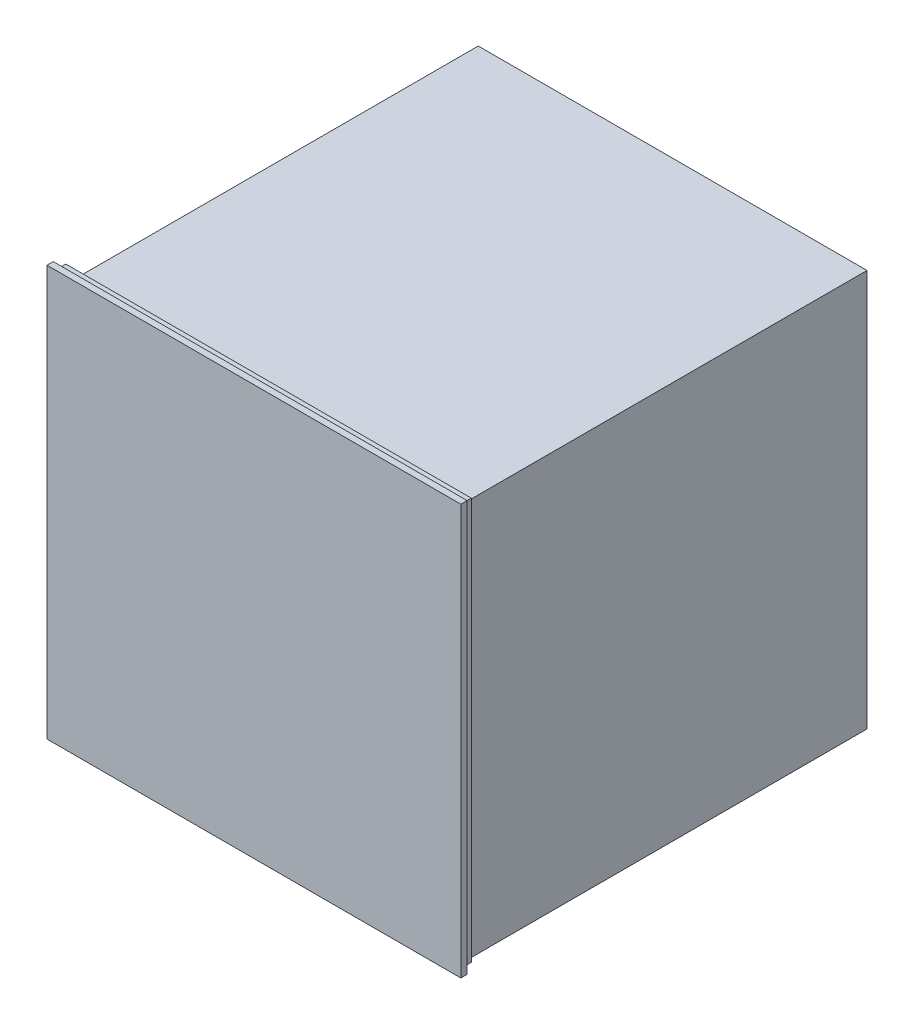
ISO-10303-21;
HEADER;
FILE_DESCRIPTION(('STEP AP214'),'2;1');
FILE_NAME('part.step','',(''),(''),'','','');
FILE_SCHEMA(('AUTOMOTIVE_DESIGN { 1 0 10303 214 1 1 1 1 }'));
ENDSEC;
DATA;
#1=APPLICATION_CONTEXT('core data for automotive mechanical design processes');
#2=APPLICATION_PROTOCOL_DEFINITION('international standard','automotive_design',2000,#1);
#3=PRODUCT_CONTEXT('',#1,'mechanical');
#4=PRODUCT('Part','Part','',(#3));
#5=PRODUCT_RELATED_PRODUCT_CATEGORY('part','',(#4));
#6=PRODUCT_DEFINITION_FORMATION('','',#4);
#7=PRODUCT_DEFINITION_CONTEXT('part definition',#1,'design');
#8=PRODUCT_DEFINITION('design','',#6,#7);
#9=PRODUCT_DEFINITION_SHAPE('','',#8);
#10=(LENGTH_UNIT() NAMED_UNIT(*) SI_UNIT(.MILLI.,.METRE.));
#11=(NAMED_UNIT(*) PLANE_ANGLE_UNIT() SI_UNIT($,.RADIAN.));
#12=(NAMED_UNIT(*) SI_UNIT($,.STERADIAN.) SOLID_ANGLE_UNIT());
#13=UNCERTAINTY_MEASURE_WITH_UNIT(LENGTH_MEASURE(1.E-05),#10,'distance_accuracy_value','');
#14=(GEOMETRIC_REPRESENTATION_CONTEXT(3) GLOBAL_UNCERTAINTY_ASSIGNED_CONTEXT((#13)) GLOBAL_UNIT_ASSIGNED_CONTEXT((#10,
#11,#12)) REPRESENTATION_CONTEXT('',''));
#15=CARTESIAN_POINT('',(0.,0.,0.));
#16=DIRECTION('',(0.,0.,1.));
#17=DIRECTION('',(1.,0.,0.));
#18=AXIS2_PLACEMENT_3D('',#15,#16,#17);
#19=CARTESIAN_POINT('',(0.,0.,0.));
#20=DIRECTION('',(0.,0.,1.));
#21=DIRECTION('',(1.,0.,0.));
#22=AXIS2_PLACEMENT_3D('',#19,#20,#21);
#23=PLANE('',#22);
#24=DIRECTION('',(0.,-1.,0.));
#25=VECTOR('',#24,1.);
#26=CARTESIAN_POINT('',(279.,275.5,0.));
#27=LINE('',#26,#25);
#28=CARTESIAN_POINT('',(279.,275.5,0.));
#29=VERTEX_POINT('',#28);
#30=CARTESIAN_POINT('',(279.,-288.5,0.));
#31=VERTEX_POINT('',#30);
#32=EDGE_CURVE('E56',#29,#31,#27,.T.);
#33=ORIENTED_EDGE('',*,*,#32,.F.);
#34=DIRECTION('',(1.,0.,0.));
#35=VECTOR('',#34,1.);
#36=CARTESIAN_POINT('',(279.,275.5,0.));
#37=LINE('',#36,#35);
#38=CARTESIAN_POINT('',(-279.,275.5,0.));
#39=VERTEX_POINT('',#38);
#40=EDGE_CURVE('E171',#39,#29,#37,.T.);
#41=ORIENTED_EDGE('',*,*,#40,.F.);
#42=DIRECTION('',(0.,1.,0.));
#43=VECTOR('',#42,1.);
#44=CARTESIAN_POINT('',(-279.,275.5,0.));
#45=LINE('',#44,#43);
#46=CARTESIAN_POINT('',(-279.,-288.5,0.));
#47=VERTEX_POINT('',#46);
#48=EDGE_CURVE('E11',#47,#39,#45,.T.);
#49=ORIENTED_EDGE('',*,*,#48,.F.);
#50=DIRECTION('',(1.,0.,0.));
#51=VECTOR('',#50,1.);
#52=CARTESIAN_POINT('',(-291.,-288.5,0.));
#53=LINE('',#52,#51);
#54=CARTESIAN_POINT('',(-291.,-288.5,0.));
#55=VERTEX_POINT('',#54);
#56=EDGE_CURVE('E198',#55,#47,#53,.T.);
#57=ORIENTED_EDGE('',*,*,#56,.F.);
#58=DIRECTION('',(0.,-1.,0.));
#59=VECTOR('',#58,1.);
#60=CARTESIAN_POINT('',(-291.,288.5,0.));
#61=LINE('',#60,#59);
#62=CARTESIAN_POINT('',(-291.,288.5,0.));
#63=VERTEX_POINT('',#62);
#64=EDGE_CURVE('E212',#63,#55,#61,.T.);
#65=ORIENTED_EDGE('',*,*,#64,.F.);
#66=DIRECTION('',(-1.,0.,0.));
#67=VECTOR('',#66,1.);
#68=CARTESIAN_POINT('',(-291.,288.5,0.));
#69=LINE('',#68,#67);
#70=CARTESIAN_POINT('',(291.,288.5,0.));
#71=VERTEX_POINT('',#70);
#72=EDGE_CURVE('E210',#71,#63,#69,.T.);
#73=ORIENTED_EDGE('',*,*,#72,.F.);
#74=DIRECTION('',(0.,1.,0.));
#75=VECTOR('',#74,1.);
#76=CARTESIAN_POINT('',(291.,288.5,0.));
#77=LINE('',#76,#75);
#78=CARTESIAN_POINT('',(291.,-288.5,0.));
#79=VERTEX_POINT('',#78);
#80=EDGE_CURVE('E193',#79,#71,#77,.T.);
#81=ORIENTED_EDGE('',*,*,#80,.F.);
#82=EDGE_CURVE('E61',#31,#79,#53,.T.);
#83=ORIENTED_EDGE('',*,*,#82,.F.);
#84=EDGE_LOOP('',(#33,#41,#49,#57,#65,#73,#81,#83));
#85=FACE_BOUND('',#84,.T.);
#86=ADVANCED_FACE('F39',(#85),#23,.F.);
#87=CARTESIAN_POINT('',(291.,288.5,12.));
#88=DIRECTION('',(-1.,0.,0.));
#89=DIRECTION('',(0.,-1.,0.));
#90=AXIS2_PLACEMENT_3D('',#87,#88,#89);
#91=PLANE('',#90);
#92=ORIENTED_EDGE('',*,*,#80,.T.);
#93=DIRECTION('',(0.,0.,-1.));
#94=VECTOR('',#93,1.);
#95=CARTESIAN_POINT('',(291.,288.5,12.));
#96=LINE('',#95,#94);
#97=CARTESIAN_POINT('',(291.,288.5,12.));
#98=VERTEX_POINT('',#97);
#99=EDGE_CURVE('E43',#98,#71,#96,.T.);
#100=ORIENTED_EDGE('',*,*,#99,.F.);
#101=DIRECTION('',(0.,1.,0.));
#102=VECTOR('',#101,1.);
#103=CARTESIAN_POINT('',(291.,288.5,12.));
#104=LINE('',#103,#102);
#105=CARTESIAN_POINT('',(291.,-288.5,12.));
#106=VERTEX_POINT('',#105);
#107=EDGE_CURVE('E194',#106,#98,#104,.T.);
#108=ORIENTED_EDGE('',*,*,#107,.F.);
#109=DIRECTION('',(0.,0.,-1.));
#110=VECTOR('',#109,1.);
#111=CARTESIAN_POINT('',(291.,-288.5,12.));
#112=LINE('',#111,#110);
#113=EDGE_CURVE('E207',#106,#79,#112,.T.);
#114=ORIENTED_EDGE('',*,*,#113,.T.);
#115=EDGE_LOOP('',(#92,#100,#108,#114));
#116=FACE_BOUND('',#115,.T.);
#117=ADVANCED_FACE('F41',(#116),#91,.F.);
#118=CARTESIAN_POINT('',(-291.,288.5,12.));
#119=DIRECTION('',(0.,-1.,0.));
#120=DIRECTION('',(0.,0.,-1.));
#121=AXIS2_PLACEMENT_3D('',#118,#119,#120);
#122=PLANE('',#121);
#123=ORIENTED_EDGE('',*,*,#72,.T.);
#124=DIRECTION('',(0.,0.,-1.));
#125=VECTOR('',#124,1.);
#126=CARTESIAN_POINT('',(-291.,288.5,12.));
#127=LINE('',#126,#125);
#128=CARTESIAN_POINT('',(-291.,288.5,12.));
#129=VERTEX_POINT('',#128);
#130=EDGE_CURVE('E221',#129,#63,#127,.T.);
#131=ORIENTED_EDGE('',*,*,#130,.F.);
#132=DIRECTION('',(-1.,0.,0.));
#133=VECTOR('',#132,1.);
#134=CARTESIAN_POINT('',(-291.,288.5,12.));
#135=LINE('',#134,#133);
#136=EDGE_CURVE('E197',#98,#129,#135,.T.);
#137=ORIENTED_EDGE('',*,*,#136,.F.);
#138=ORIENTED_EDGE('',*,*,#99,.T.);
#139=EDGE_LOOP('',(#123,#131,#137,#138));
#140=FACE_BOUND('',#139,.T.);
#141=ADVANCED_FACE('F229',(#140),#122,.F.);
#142=CARTESIAN_POINT('',(-291.,288.5,12.));
#143=DIRECTION('',(1.,0.,0.));
#144=DIRECTION('',(0.,1.,0.));
#145=AXIS2_PLACEMENT_3D('',#142,#143,#144);
#146=PLANE('',#145);
#147=ORIENTED_EDGE('',*,*,#64,.T.);
#148=DIRECTION('',(0.,0.,-1.));
#149=VECTOR('',#148,1.);
#150=CARTESIAN_POINT('',(-291.,-288.5,12.));
#151=LINE('',#150,#149);
#152=CARTESIAN_POINT('',(-291.,-288.5,12.));
#153=VERTEX_POINT('',#152);
#154=EDGE_CURVE('E219',#153,#55,#151,.T.);
#155=ORIENTED_EDGE('',*,*,#154,.F.);
#156=DIRECTION('',(0.,-1.,0.));
#157=VECTOR('',#156,1.);
#158=CARTESIAN_POINT('',(-291.,288.5,12.));
#159=LINE('',#158,#157);
#160=EDGE_CURVE('E201',#129,#153,#159,.T.);
#161=ORIENTED_EDGE('',*,*,#160,.F.);
#162=ORIENTED_EDGE('',*,*,#130,.T.);
#163=EDGE_LOOP('',(#147,#155,#161,#162));
#164=FACE_BOUND('',#163,.T.);
#165=ADVANCED_FACE('F233',(#164),#146,.F.);
#166=CARTESIAN_POINT('',(-291.,-288.5,12.));
#167=DIRECTION('',(0.,1.,0.));
#168=DIRECTION('',(0.,0.,1.));
#169=AXIS2_PLACEMENT_3D('',#166,#167,#168);
#170=PLANE('',#169);
#171=ORIENTED_EDGE('',*,*,#56,.T.);
#172=EDGE_CURVE('E216',#47,#31,#53,.T.);
#173=ORIENTED_EDGE('',*,*,#172,.T.);
#174=ORIENTED_EDGE('',*,*,#82,.T.);
#175=ORIENTED_EDGE('',*,*,#113,.F.);
#176=DIRECTION('',(1.,0.,0.));
#177=VECTOR('',#176,1.);
#178=CARTESIAN_POINT('',(-291.,-288.5,12.));
#179=LINE('',#178,#177);
#180=EDGE_CURVE('E204',#153,#106,#179,.T.);
#181=ORIENTED_EDGE('',*,*,#180,.F.);
#182=ORIENTED_EDGE('',*,*,#154,.T.);
#183=EDGE_LOOP('',(#171,#173,#174,#175,#181,#182));
#184=FACE_BOUND('',#183,.T.);
#185=ADVANCED_FACE('F236',(#184),#170,.F.);
#186=CARTESIAN_POINT('',(279.,275.5,-580.));
#187=DIRECTION('',(-1.,0.,0.));
#188=DIRECTION('',(0.,-1.,0.));
#189=AXIS2_PLACEMENT_3D('',#186,#187,#188);
#190=PLANE('',#189);
#191=ORIENTED_EDGE('',*,*,#32,.T.);
#192=CARTESIAN_POINT('',(279.,-294.5,0.));
#193=VERTEX_POINT('',#192);
#194=EDGE_CURVE('E160',#31,#193,#27,.T.);
#195=ORIENTED_EDGE('',*,*,#194,.T.);
#196=DIRECTION('',(0.,0.,1.));
#197=VECTOR('',#196,1.);
#198=CARTESIAN_POINT('',(279.,-294.5,-580.));
#199=LINE('',#198,#197);
#200=CARTESIAN_POINT('',(279.,-294.5,-580.));
#201=VERTEX_POINT('',#200);
#202=EDGE_CURVE('E190',#201,#193,#199,.T.);
#203=ORIENTED_EDGE('',*,*,#202,.F.);
#204=DIRECTION('',(0.,-1.,0.));
#205=VECTOR('',#204,1.);
#206=CARTESIAN_POINT('',(279.,275.5,-580.));
#207=LINE('',#206,#205);
#208=CARTESIAN_POINT('',(279.,275.5,-580.));
#209=VERTEX_POINT('',#208);
#210=EDGE_CURVE('E167',#209,#201,#207,.T.);
#211=ORIENTED_EDGE('',*,*,#210,.F.);
#212=DIRECTION('',(0.,0.,1.));
#213=VECTOR('',#212,1.);
#214=CARTESIAN_POINT('',(279.,275.5,-580.));
#215=LINE('',#214,#213);
#216=EDGE_CURVE('E176',#209,#29,#215,.T.);
#217=ORIENTED_EDGE('',*,*,#216,.T.);
#218=EDGE_LOOP('',(#191,#195,#203,#211,#217));
#219=FACE_BOUND('',#218,.T.);
#220=ADVANCED_FACE('F261',(#219),#190,.F.);
#221=CARTESIAN_POINT('',(279.,-294.5,-580.));
#222=DIRECTION('',(0.,1.,0.));
#223=DIRECTION('',(0.,0.,1.));
#224=AXIS2_PLACEMENT_3D('',#221,#222,#223);
#225=PLANE('',#224);
#226=DIRECTION('',(-1.,0.,0.));
#227=VECTOR('',#226,1.);
#228=CARTESIAN_POINT('',(279.,-294.5,0.));
#229=LINE('',#228,#227);
#230=CARTESIAN_POINT('',(-279.,-294.5,0.));
#231=VERTEX_POINT('',#230);
#232=EDGE_CURVE('E178',#193,#231,#229,.T.);
#233=ORIENTED_EDGE('',*,*,#232,.T.);
#234=DIRECTION('',(0.,0.,1.));
#235=VECTOR('',#234,1.);
#236=CARTESIAN_POINT('',(-279.,-294.5,-580.));
#237=LINE('',#236,#235);
#238=CARTESIAN_POINT('',(-279.,-294.5,-580.));
#239=VERTEX_POINT('',#238);
#240=EDGE_CURVE('E187',#239,#231,#237,.T.);
#241=ORIENTED_EDGE('',*,*,#240,.F.);
#242=DIRECTION('',(-1.,0.,0.));
#243=VECTOR('',#242,1.);
#244=CARTESIAN_POINT('',(279.,-294.5,-580.));
#245=LINE('',#244,#243);
#246=EDGE_CURVE('E170',#201,#239,#245,.T.);
#247=ORIENTED_EDGE('',*,*,#246,.F.);
#248=ORIENTED_EDGE('',*,*,#202,.T.);
#249=EDGE_LOOP('',(#233,#241,#247,#248));
#250=FACE_BOUND('',#249,.T.);
#251=ADVANCED_FACE('F285',(#250),#225,.F.);
#252=CARTESIAN_POINT('',(-279.,275.5,-580.));
#253=DIRECTION('',(1.,0.,0.));
#254=DIRECTION('',(0.,1.,0.));
#255=AXIS2_PLACEMENT_3D('',#252,#253,#254);
#256=PLANE('',#255);
#257=EDGE_CURVE('E49',#231,#47,#45,.T.);
#258=ORIENTED_EDGE('',*,*,#257,.T.);
#259=ORIENTED_EDGE('',*,*,#48,.T.);
#260=DIRECTION('',(0.,0.,1.));
#261=VECTOR('',#260,1.);
#262=CARTESIAN_POINT('',(-279.,275.5,-580.));
#263=LINE('',#262,#261);
#264=CARTESIAN_POINT('',(-279.,275.5,-580.));
#265=VERTEX_POINT('',#264);
#266=EDGE_CURVE('E184',#265,#39,#263,.T.);
#267=ORIENTED_EDGE('',*,*,#266,.F.);
#268=DIRECTION('',(0.,1.,0.));
#269=VECTOR('',#268,1.);
#270=CARTESIAN_POINT('',(-279.,275.5,-580.));
#271=LINE('',#270,#269);
#272=EDGE_CURVE('E173',#239,#265,#271,.T.);
#273=ORIENTED_EDGE('',*,*,#272,.F.);
#274=ORIENTED_EDGE('',*,*,#240,.T.);
#275=EDGE_LOOP('',(#258,#259,#267,#273,#274));
#276=FACE_BOUND('',#275,.T.);
#277=ADVANCED_FACE('F292',(#276),#256,.F.);
#278=CARTESIAN_POINT('',(279.,275.5,-580.));
#279=DIRECTION('',(0.,-1.,0.));
#280=DIRECTION('',(0.,0.,-1.));
#281=AXIS2_PLACEMENT_3D('',#278,#279,#280);
#282=PLANE('',#281);
#283=ORIENTED_EDGE('',*,*,#40,.T.);
#284=ORIENTED_EDGE('',*,*,#216,.F.);
#285=DIRECTION('',(1.,0.,0.));
#286=VECTOR('',#285,1.);
#287=CARTESIAN_POINT('',(279.,275.5,-580.));
#288=LINE('',#287,#286);
#289=EDGE_CURVE('E175',#265,#209,#288,.T.);
#290=ORIENTED_EDGE('',*,*,#289,.F.);
#291=ORIENTED_EDGE('',*,*,#266,.T.);
#292=EDGE_LOOP('',(#283,#284,#290,#291));
#293=FACE_BOUND('',#292,.T.);
#294=ADVANCED_FACE('F299',(#293),#282,.F.);
#295=CARTESIAN_POINT('',(0.,0.,-580.));
#296=DIRECTION('',(0.,0.,-1.));
#297=DIRECTION('',(-1.,0.,0.));
#298=AXIS2_PLACEMENT_3D('',#295,#296,#297);
#299=PLANE('',#298);
#300=ORIENTED_EDGE('',*,*,#210,.T.);
#301=ORIENTED_EDGE('',*,*,#246,.T.);
#302=ORIENTED_EDGE('',*,*,#272,.T.);
#303=ORIENTED_EDGE('',*,*,#289,.T.);
#304=EDGE_LOOP('',(#300,#301,#302,#303));
#305=FACE_BOUND('',#304,.T.);
#306=ADVANCED_FACE('F249',(#305),#299,.T.);
#307=CARTESIAN_POINT('',(0.,0.,0.));
#308=DIRECTION('',(0.,0.,-1.));
#309=DIRECTION('',(-1.,0.,0.));
#310=AXIS2_PLACEMENT_3D('',#307,#308,#309);
#311=PLANE('',#310);
#312=ORIENTED_EDGE('',*,*,#172,.F.);
#313=ORIENTED_EDGE('',*,*,#257,.F.);
#314=ORIENTED_EDGE('',*,*,#232,.F.);
#315=ORIENTED_EDGE('',*,*,#194,.F.);
#316=EDGE_LOOP('',(#312,#313,#314,#315));
#317=FACE_BOUND('',#316,.T.);
#318=ADVANCED_FACE('F241',(#317),#311,.F.);
#319=CARTESIAN_POINT('',(0.,0.,12.));
#320=DIRECTION('',(0.,0.,1.));
#321=DIRECTION('',(1.,0.,0.));
#322=AXIS2_PLACEMENT_3D('',#319,#320,#321);
#323=PLANE('',#322);
#324=DIRECTION('',(0.,1.,0.));
#325=VECTOR('',#324,1.);
#326=CARTESIAN_POINT('',(297.,294.5,12.));
#327=LINE('',#326,#325);
#328=CARTESIAN_POINT('',(297.,-294.5,12.));
#329=VERTEX_POINT('',#328);
#330=CARTESIAN_POINT('',(297.,294.5,12.));
#331=VERTEX_POINT('',#330);
#332=EDGE_CURVE('E159',#329,#331,#327,.T.);
#333=ORIENTED_EDGE('',*,*,#332,.F.);
#334=DIRECTION('',(1.,0.,0.));
#335=VECTOR('',#334,1.);
#336=CARTESIAN_POINT('',(-297.,-294.5,12.));
#337=LINE('',#336,#335);
#338=CARTESIAN_POINT('',(-297.,-294.5,12.));
#339=VERTEX_POINT('',#338);
#340=EDGE_CURVE('E155',#339,#329,#337,.T.);
#341=ORIENTED_EDGE('',*,*,#340,.F.);
#342=DIRECTION('',(0.,-1.,0.));
#343=VECTOR('',#342,1.);
#344=CARTESIAN_POINT('',(-297.,294.5,12.));
#345=LINE('',#344,#343);
#346=CARTESIAN_POINT('',(-297.,294.5,12.));
#347=VERTEX_POINT('',#346);
#348=EDGE_CURVE('E396',#347,#339,#345,.T.);
#349=ORIENTED_EDGE('',*,*,#348,.F.);
#350=DIRECTION('',(-1.,0.,0.));
#351=VECTOR('',#350,1.);
#352=CARTESIAN_POINT('',(-297.,294.5,12.));
#353=LINE('',#352,#351);
#354=EDGE_CURVE('E399',#331,#347,#353,.T.);
#355=ORIENTED_EDGE('',*,*,#354,.F.);
#356=EDGE_LOOP('',(#333,#341,#349,#355));
#357=FACE_BOUND('',#356,.T.);
#358=ORIENTED_EDGE('',*,*,#180,.T.);
#359=ORIENTED_EDGE('',*,*,#107,.T.);
#360=ORIENTED_EDGE('',*,*,#136,.T.);
#361=ORIENTED_EDGE('',*,*,#160,.T.);
#362=EDGE_LOOP('',(#358,#359,#360,#361));
#363=FACE_BOUND('',#362,.T.);
#364=ADVANCED_FACE('F239',(#357,#363),#323,.F.);
#365=CARTESIAN_POINT('',(297.,294.5,21.));
#366=DIRECTION('',(-1.,0.,0.));
#367=DIRECTION('',(0.,-1.,0.));
#368=AXIS2_PLACEMENT_3D('',#365,#366,#367);
#369=PLANE('',#368);
#370=ORIENTED_EDGE('',*,*,#332,.T.);
#371=DIRECTION('',(0.,0.,-1.));
#372=VECTOR('',#371,1.);
#373=CARTESIAN_POINT('',(297.,294.5,21.));
#374=LINE('',#373,#372);
#375=CARTESIAN_POINT('',(297.,294.5,21.));
#376=VERTEX_POINT('',#375);
#377=EDGE_CURVE('E139',#376,#331,#374,.T.);
#378=ORIENTED_EDGE('',*,*,#377,.F.);
#379=DIRECTION('',(0.,1.,0.));
#380=VECTOR('',#379,1.);
#381=CARTESIAN_POINT('',(297.,294.5,21.));
#382=LINE('',#381,#380);
#383=CARTESIAN_POINT('',(297.,-294.5,21.));
#384=VERTEX_POINT('',#383);
#385=EDGE_CURVE('E146',#384,#376,#382,.T.);
#386=ORIENTED_EDGE('',*,*,#385,.F.);
#387=DIRECTION('',(0.,0.,-1.));
#388=VECTOR('',#387,1.);
#389=CARTESIAN_POINT('',(297.,-294.5,21.));
#390=LINE('',#389,#388);
#391=EDGE_CURVE('E393',#384,#329,#390,.T.);
#392=ORIENTED_EDGE('',*,*,#391,.T.);
#393=EDGE_LOOP('',(#370,#378,#386,#392));
#394=FACE_BOUND('',#393,.T.);
#395=ADVANCED_FACE('F157',(#394),#369,.F.);
#396=CARTESIAN_POINT('',(-297.,294.5,21.));
#397=DIRECTION('',(0.,-1.,0.));
#398=DIRECTION('',(0.,0.,-1.));
#399=AXIS2_PLACEMENT_3D('',#396,#397,#398);
#400=PLANE('',#399);
#401=ORIENTED_EDGE('',*,*,#354,.T.);
#402=DIRECTION('',(0.,0.,-1.));
#403=VECTOR('',#402,1.);
#404=CARTESIAN_POINT('',(-297.,294.5,21.));
#405=LINE('',#404,#403);
#406=CARTESIAN_POINT('',(-297.,294.5,21.));
#407=VERTEX_POINT('',#406);
#408=EDGE_CURVE('E142',#407,#347,#405,.T.);
#409=ORIENTED_EDGE('',*,*,#408,.F.);
#410=DIRECTION('',(-1.,0.,0.));
#411=VECTOR('',#410,1.);
#412=CARTESIAN_POINT('',(-297.,294.5,21.));
#413=LINE('',#412,#411);
#414=EDGE_CURVE('E135',#376,#407,#413,.T.);
#415=ORIENTED_EDGE('',*,*,#414,.F.);
#416=ORIENTED_EDGE('',*,*,#377,.T.);
#417=EDGE_LOOP('',(#401,#409,#415,#416));
#418=FACE_BOUND('',#417,.T.);
#419=ADVANCED_FACE('F137',(#418),#400,.F.);
#420=CARTESIAN_POINT('',(-297.,294.5,21.));
#421=DIRECTION('',(1.,0.,0.));
#422=DIRECTION('',(0.,1.,0.));
#423=AXIS2_PLACEMENT_3D('',#420,#421,#422);
#424=PLANE('',#423);
#425=ORIENTED_EDGE('',*,*,#348,.T.);
#426=DIRECTION('',(0.,0.,-1.));
#427=VECTOR('',#426,1.);
#428=CARTESIAN_POINT('',(-297.,-294.5,21.));
#429=LINE('',#428,#427);
#430=CARTESIAN_POINT('',(-297.,-294.5,21.));
#431=VERTEX_POINT('',#430);
#432=EDGE_CURVE('E163',#431,#339,#429,.T.);
#433=ORIENTED_EDGE('',*,*,#432,.F.);
#434=DIRECTION('',(0.,-1.,0.));
#435=VECTOR('',#434,1.);
#436=CARTESIAN_POINT('',(-297.,294.5,21.));
#437=LINE('',#436,#435);
#438=EDGE_CURVE('E145',#407,#431,#437,.T.);
#439=ORIENTED_EDGE('',*,*,#438,.F.);
#440=ORIENTED_EDGE('',*,*,#408,.T.);
#441=EDGE_LOOP('',(#425,#433,#439,#440));
#442=FACE_BOUND('',#441,.T.);
#443=ADVANCED_FACE('F362',(#442),#424,.F.);
#444=CARTESIAN_POINT('',(-297.,-294.5,21.));
#445=DIRECTION('',(0.,1.,0.));
#446=DIRECTION('',(0.,0.,1.));
#447=AXIS2_PLACEMENT_3D('',#444,#445,#446);
#448=PLANE('',#447);
#449=ORIENTED_EDGE('',*,*,#340,.T.);
#450=ORIENTED_EDGE('',*,*,#391,.F.);
#451=DIRECTION('',(1.,0.,0.));
#452=VECTOR('',#451,1.);
#453=CARTESIAN_POINT('',(-297.,-294.5,21.));
#454=LINE('',#453,#452);
#455=EDGE_CURVE('E151',#431,#384,#454,.T.);
#456=ORIENTED_EDGE('',*,*,#455,.F.);
#457=ORIENTED_EDGE('',*,*,#432,.T.);
#458=EDGE_LOOP('',(#449,#450,#456,#457));
#459=FACE_BOUND('',#458,.T.);
#460=ADVANCED_FACE('F370',(#459),#448,.F.);
#461=CARTESIAN_POINT('',(0.,0.,21.));
#462=DIRECTION('',(0.,0.,1.));
#463=DIRECTION('',(1.,0.,0.));
#464=AXIS2_PLACEMENT_3D('',#461,#462,#463);
#465=PLANE('',#464);
#466=ORIENTED_EDGE('',*,*,#385,.T.);
#467=ORIENTED_EDGE('',*,*,#414,.T.);
#468=ORIENTED_EDGE('',*,*,#438,.T.);
#469=ORIENTED_EDGE('',*,*,#455,.T.);
#470=EDGE_LOOP('',(#466,#467,#468,#469));
#471=FACE_BOUND('',#470,.T.);
#472=ADVANCED_FACE('F149',(#471),#465,.T.);
#473=CLOSED_SHELL('',(#86,#117,#141,#165,#185,#220,#251,#277,#294,#306,#318,#364,#395,#419,#443,
#460,#472));
#474=MANIFOLD_SOLID_BREP('B2',#473);
#475=ADVANCED_BREP_SHAPE_REPRESENTATION('',(#18,#474),#14);
#476=SHAPE_DEFINITION_REPRESENTATION(#9,#475);
ENDSEC;
END-ISO-10303-21;
